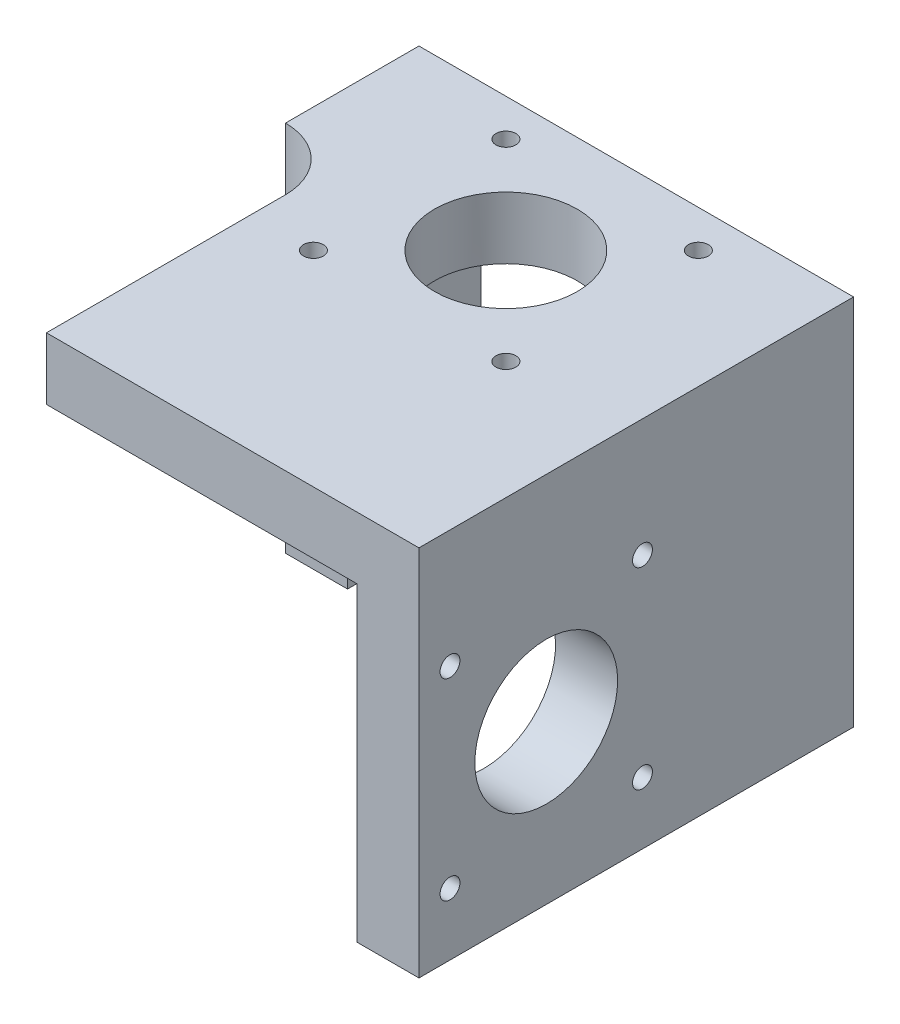
ISO-10303-21;
HEADER;
FILE_DESCRIPTION(('STEP AP214'),'2;1');
FILE_NAME('part.step','',(''),(''),'','','');
FILE_SCHEMA(('AUTOMOTIVE_DESIGN { 1 0 10303 214 1 1 1 1 }'));
ENDSEC;
DATA;
#1=APPLICATION_CONTEXT('core data for automotive mechanical design processes');
#2=APPLICATION_PROTOCOL_DEFINITION('international standard','automotive_design',2000,#1);
#3=PRODUCT_CONTEXT('',#1,'mechanical');
#4=PRODUCT('Part','Part','',(#3));
#5=PRODUCT_RELATED_PRODUCT_CATEGORY('part','',(#4));
#6=PRODUCT_DEFINITION_FORMATION('','',#4);
#7=PRODUCT_DEFINITION_CONTEXT('part definition',#1,'design');
#8=PRODUCT_DEFINITION('design','',#6,#7);
#9=PRODUCT_DEFINITION_SHAPE('','',#8);
#10=(LENGTH_UNIT() NAMED_UNIT(*) SI_UNIT(.MILLI.,.METRE.));
#11=(NAMED_UNIT(*) PLANE_ANGLE_UNIT() SI_UNIT($,.RADIAN.));
#12=(NAMED_UNIT(*) SI_UNIT($,.STERADIAN.) SOLID_ANGLE_UNIT());
#13=UNCERTAINTY_MEASURE_WITH_UNIT(LENGTH_MEASURE(1.E-05),#10,'distance_accuracy_value','');
#14=(GEOMETRIC_REPRESENTATION_CONTEXT(3) GLOBAL_UNCERTAINTY_ASSIGNED_CONTEXT((#13)) GLOBAL_UNIT_ASSIGNED_CONTEXT((#10,
#11,#12)) REPRESENTATION_CONTEXT('',''));
#15=CARTESIAN_POINT('',(0.,0.,0.));
#16=DIRECTION('',(0.,0.,1.));
#17=DIRECTION('',(1.,0.,0.));
#18=AXIS2_PLACEMENT_3D('',#15,#16,#17);
#19=CARTESIAN_POINT('',(0.,0.,21.5));
#20=DIRECTION('',(0.,0.,-1.));
#21=DIRECTION('',(-1.,0.,0.));
#22=AXIS2_PLACEMENT_3D('',#19,#20,#21);
#23=PLANE('',#22);
#24=DIRECTION('',(0.,-1.,0.));
#25=VECTOR('',#24,1.);
#26=CARTESIAN_POINT('',(-47.5,20.0735294117647,21.5));
#27=LINE('',#26,#25);
#28=CARTESIAN_POINT('',(-47.5,-23.4764705882353,21.5));
#29=VERTEX_POINT('',#28);
#30=CARTESIAN_POINT('',(-47.5,-39.9264705882353,21.5));
#31=VERTEX_POINT('',#30);
#32=EDGE_CURVE('E159',#29,#31,#27,.T.);
#33=ORIENTED_EDGE('',*,*,#32,.F.);
#34=DIRECTION('',(-1.,0.,0.));
#35=VECTOR('',#34,1.);
#36=CARTESIAN_POINT('',(-37.,-23.4764705882353,21.5));
#37=LINE('',#36,#35);
#38=CARTESIAN_POINT('',(-57.5,-23.4764705882353,21.5));
#39=VERTEX_POINT('',#38);
#40=EDGE_CURVE('E142',#29,#39,#37,.T.);
#41=ORIENTED_EDGE('',*,*,#40,.T.);
#42=DIRECTION('',(0.,1.,0.));
#43=VECTOR('',#42,1.);
#44=CARTESIAN_POINT('',(-57.5,20.0735294117647,21.5));
#45=LINE('',#44,#43);
#46=CARTESIAN_POINT('',(-57.5,-39.9264705882353,21.5));
#47=VERTEX_POINT('',#46);
#48=EDGE_CURVE('E157',#47,#39,#45,.T.);
#49=ORIENTED_EDGE('',*,*,#48,.F.);
#50=DIRECTION('',(-1.,0.,0.));
#51=VECTOR('',#50,1.);
#52=CARTESIAN_POINT('',(-47.5,-39.9264705882353,21.5));
#53=LINE('',#52,#51);
#54=EDGE_CURVE('E177',#31,#47,#53,.T.);
#55=ORIENTED_EDGE('',*,*,#54,.F.);
#56=EDGE_LOOP('',(#33,#41,#49,#55));
#57=FACE_BOUND('',#56,.T.);
#58=ADVANCED_FACE('F47',(#57),#23,.F.);
#59=CARTESIAN_POINT('',(0.,10.0735294117647,70.));
#60=DIRECTION('',(0.,1.,0.));
#61=DIRECTION('',(-1.,0.,0.));
#62=AXIS2_PLACEMENT_3D('',#59,#60,#61);
#63=PLANE('',#62);
#64=CARTESIAN_POINT('',(-22.,10.0735294117647,21.5));
#65=DIRECTION('',(0.,-1.,0.));
#66=DIRECTION('',(1.,0.,0.));
#67=AXIS2_PLACEMENT_3D('',#64,#65,#66);
#68=CIRCLE('',#67,11.5);
#69=CARTESIAN_POINT('',(-10.5,10.0735294117647,21.5));
#70=VERTEX_POINT('',#69);
#71=EDGE_CURVE('E241',#70,#70,#68,.T.);
#72=ORIENTED_EDGE('',*,*,#71,.F.);
#73=EDGE_LOOP('',(#72));
#74=FACE_BOUND('',#73,.T.);
#75=CARTESIAN_POINT('',(-6.49999999999999,10.0735294117647,37.));
#76=DIRECTION('',(0.,-1.,0.));
#77=DIRECTION('',(1.,0.,0.));
#78=AXIS2_PLACEMENT_3D('',#75,#76,#77);
#79=CIRCLE('',#78,1.59999999999999);
#80=CARTESIAN_POINT('',(-4.9,10.0735294117647,37.));
#81=VERTEX_POINT('',#80);
#82=EDGE_CURVE('E237',#81,#81,#79,.T.);
#83=ORIENTED_EDGE('',*,*,#82,.F.);
#84=EDGE_LOOP('',(#83));
#85=FACE_BOUND('',#84,.T.);
#86=CARTESIAN_POINT('',(-6.49999999999999,10.0735294117647,6.));
#87=DIRECTION('',(0.,-1.,0.));
#88=DIRECTION('',(1.,0.,0.));
#89=AXIS2_PLACEMENT_3D('',#86,#87,#88);
#90=CIRCLE('',#89,1.6);
#91=CARTESIAN_POINT('',(-4.89999999999999,10.0735294117647,6.));
#92=VERTEX_POINT('',#91);
#93=EDGE_CURVE('E233',#92,#92,#90,.T.);
#94=ORIENTED_EDGE('',*,*,#93,.F.);
#95=EDGE_LOOP('',(#94));
#96=FACE_BOUND('',#95,.T.);
#97=CARTESIAN_POINT('',(-37.5,10.0735294117647,6.));
#98=DIRECTION('',(0.,-1.,0.));
#99=DIRECTION('',(1.,0.,0.));
#100=AXIS2_PLACEMENT_3D('',#97,#98,#99);
#101=CIRCLE('',#100,1.6);
#102=CARTESIAN_POINT('',(-35.9,10.0735294117647,6.));
#103=VERTEX_POINT('',#102);
#104=EDGE_CURVE('E228',#103,#103,#101,.T.);
#105=ORIENTED_EDGE('',*,*,#104,.F.);
#106=EDGE_LOOP('',(#105));
#107=FACE_BOUND('',#106,.T.);
#108=CARTESIAN_POINT('',(-37.5,10.0735294117647,37.));
#109=DIRECTION('',(0.,-1.,0.));
#110=DIRECTION('',(1.,0.,0.));
#111=AXIS2_PLACEMENT_3D('',#108,#109,#110);
#112=CIRCLE('',#111,1.6);
#113=CARTESIAN_POINT('',(-35.9,10.0735294117647,37.));
#114=VERTEX_POINT('',#113);
#115=EDGE_CURVE('E232',#114,#114,#112,.T.);
#116=ORIENTED_EDGE('',*,*,#115,.F.);
#117=EDGE_LOOP('',(#116));
#118=FACE_BOUND('',#117,.T.);
#119=DIRECTION('',(0.,0.,-1.));
#120=VECTOR('',#119,1.);
#121=CARTESIAN_POINT('',(-47.5,10.0735294117647,70.));
#122=LINE('',#121,#120);
#123=CARTESIAN_POINT('',(-47.5,10.0735294117647,70.));
#124=VERTEX_POINT('',#123);
#125=CARTESIAN_POINT('',(-47.5,10.0735294117647,31.5));
#126=VERTEX_POINT('',#125);
#127=EDGE_CURVE('E294',#124,#126,#122,.T.);
#128=ORIENTED_EDGE('',*,*,#127,.T.);
#129=CARTESIAN_POINT('',(-47.5,10.0735294117647,0.));
#130=VERTEX_POINT('',#129);
#131=EDGE_CURVE('E273',#126,#130,#122,.T.);
#132=ORIENTED_EDGE('',*,*,#131,.T.);
#133=DIRECTION('',(1.,0.,0.));
#134=VECTOR('',#133,1.);
#135=CARTESIAN_POINT('',(0.,10.0735294117647,0.));
#136=LINE('',#135,#134);
#137=CARTESIAN_POINT('',(2.50000000000001,10.0735294117647,0.));
#138=VERTEX_POINT('',#137);
#139=EDGE_CURVE('E274',#130,#138,#136,.T.);
#140=ORIENTED_EDGE('',*,*,#139,.T.);
#141=DIRECTION('',(0.,0.,-1.));
#142=VECTOR('',#141,1.);
#143=CARTESIAN_POINT('',(2.50000000000001,10.0735294117647,70.));
#144=LINE('',#143,#142);
#145=CARTESIAN_POINT('',(2.50000000000001,10.0735294117647,70.));
#146=VERTEX_POINT('',#145);
#147=EDGE_CURVE('E311',#146,#138,#144,.T.);
#148=ORIENTED_EDGE('',*,*,#147,.F.);
#149=DIRECTION('',(1.,0.,0.));
#150=VECTOR('',#149,1.);
#151=CARTESIAN_POINT('',(0.,10.0735294117647,70.));
#152=LINE('',#151,#150);
#153=EDGE_CURVE('E250',#124,#146,#152,.T.);
#154=ORIENTED_EDGE('',*,*,#153,.F.);
#155=EDGE_LOOP('',(#128,#132,#140,#148,#154));
#156=FACE_BOUND('',#155,.T.);
#157=ADVANCED_FACE('F374',(#74,#85,#96,#107,#118,#156),#63,.F.);
#158=CARTESIAN_POINT('',(2.50000000000001,0.,70.));
#159=DIRECTION('',(1.,0.,0.));
#160=DIRECTION('',(0.,1.,0.));
#161=AXIS2_PLACEMENT_3D('',#158,#159,#160);
#162=PLANE('',#161);
#163=CARTESIAN_POINT('',(2.50000000000001,-14.4264705882353,49.5));
#164=DIRECTION('',(-1.,0.,0.));
#165=DIRECTION('',(0.,-1.,0.));
#166=AXIS2_PLACEMENT_3D('',#163,#164,#165);
#167=CIRCLE('',#166,11.5);
#168=CARTESIAN_POINT('',(2.50000000000002,-25.9264705882353,49.5));
#169=VERTEX_POINT('',#168);
#170=EDGE_CURVE('E205',#169,#169,#167,.T.);
#171=ORIENTED_EDGE('',*,*,#170,.F.);
#172=EDGE_LOOP('',(#171));
#173=FACE_BOUND('',#172,.T.);
#174=CARTESIAN_POINT('',(2.50000000000001,1.0735294117647,65.));
#175=DIRECTION('',(-1.,0.,0.));
#176=DIRECTION('',(0.,-1.,0.));
#177=AXIS2_PLACEMENT_3D('',#174,#175,#176);
#178=CIRCLE('',#177,1.60000000000001);
#179=CARTESIAN_POINT('',(2.50000000000001,-0.526470588235301,65.));
#180=VERTEX_POINT('',#179);
#181=EDGE_CURVE('E217',#180,#180,#178,.T.);
#182=ORIENTED_EDGE('',*,*,#181,.F.);
#183=EDGE_LOOP('',(#182));
#184=FACE_BOUND('',#183,.T.);
#185=CARTESIAN_POINT('',(2.50000000000002,-29.9264705882353,65.));
#186=DIRECTION('',(-1.,0.,0.));
#187=DIRECTION('',(0.,-1.,0.));
#188=AXIS2_PLACEMENT_3D('',#185,#186,#187);
#189=CIRCLE('',#188,1.6);
#190=CARTESIAN_POINT('',(2.50000000000002,-31.5264705882353,65.));
#191=VERTEX_POINT('',#190);
#192=EDGE_CURVE('E213',#191,#191,#189,.T.);
#193=ORIENTED_EDGE('',*,*,#192,.F.);
#194=EDGE_LOOP('',(#193));
#195=FACE_BOUND('',#194,.T.);
#196=CARTESIAN_POINT('',(2.50000000000002,-29.9264705882353,34.));
#197=DIRECTION('',(-1.,0.,0.));
#198=DIRECTION('',(0.,-1.,0.));
#199=AXIS2_PLACEMENT_3D('',#196,#197,#198);
#200=CIRCLE('',#199,1.6);
#201=CARTESIAN_POINT('',(2.50000000000002,-31.5264705882353,34.));
#202=VERTEX_POINT('',#201);
#203=EDGE_CURVE('E208',#202,#202,#200,.T.);
#204=ORIENTED_EDGE('',*,*,#203,.F.);
#205=EDGE_LOOP('',(#204));
#206=FACE_BOUND('',#205,.T.);
#207=CARTESIAN_POINT('',(2.50000000000001,1.0735294117647,34.));
#208=DIRECTION('',(-1.,0.,0.));
#209=DIRECTION('',(0.,-1.,0.));
#210=AXIS2_PLACEMENT_3D('',#207,#208,#209);
#211=CIRCLE('',#210,1.60000000000001);
#212=CARTESIAN_POINT('',(2.50000000000001,-0.526470588235301,34.));
#213=VERTEX_POINT('',#212);
#214=EDGE_CURVE('E212',#213,#213,#211,.T.);
#215=ORIENTED_EDGE('',*,*,#214,.F.);
#216=EDGE_LOOP('',(#215));
#217=FACE_BOUND('',#216,.T.);
#218=DIRECTION('',(0.,-1.,0.));
#219=VECTOR('',#218,1.);
#220=CARTESIAN_POINT('',(2.50000000000001,0.,0.));
#221=LINE('',#220,#219);
#222=CARTESIAN_POINT('',(2.50000000000002,-39.9264705882353,0.));
#223=VERTEX_POINT('',#222);
#224=EDGE_CURVE('E278',#138,#223,#221,.T.);
#225=ORIENTED_EDGE('',*,*,#224,.T.);
#226=DIRECTION('',(0.,0.,-1.));
#227=VECTOR('',#226,1.);
#228=CARTESIAN_POINT('',(2.50000000000002,-39.9264705882353,70.));
#229=LINE('',#228,#227);
#230=CARTESIAN_POINT('',(2.50000000000002,-39.9264705882353,70.));
#231=VERTEX_POINT('',#230);
#232=EDGE_CURVE('E308',#231,#223,#229,.T.);
#233=ORIENTED_EDGE('',*,*,#232,.F.);
#234=DIRECTION('',(0.,-1.,0.));
#235=VECTOR('',#234,1.);
#236=CARTESIAN_POINT('',(2.50000000000001,0.,70.));
#237=LINE('',#236,#235);
#238=EDGE_CURVE('E254',#146,#231,#237,.T.);
#239=ORIENTED_EDGE('',*,*,#238,.F.);
#240=ORIENTED_EDGE('',*,*,#147,.T.);
#241=EDGE_LOOP('',(#225,#233,#239,#240));
#242=FACE_BOUND('',#241,.T.);
#243=ADVANCED_FACE('F395',(#173,#184,#195,#206,#217,#242),#162,.F.);
#244=CARTESIAN_POINT('',(0.,-39.9264705882353,70.));
#245=DIRECTION('',(0.,-1.,0.));
#246=DIRECTION('',(1.,0.,0.));
#247=AXIS2_PLACEMENT_3D('',#244,#245,#246);
#248=PLANE('',#247);
#249=DIRECTION('',(-1.,0.,0.));
#250=VECTOR('',#249,1.);
#251=CARTESIAN_POINT('',(0.,-39.9264705882353,0.));
#252=LINE('',#251,#250);
#253=CARTESIAN_POINT('',(12.5,-39.9264705882353,0.));
#254=VERTEX_POINT('',#253);
#255=EDGE_CURVE('E283',#254,#223,#252,.T.);
#256=ORIENTED_EDGE('',*,*,#255,.F.);
#257=DIRECTION('',(0.,0.,-1.));
#258=VECTOR('',#257,1.);
#259=CARTESIAN_POINT('',(12.5,-39.9264705882353,70.));
#260=LINE('',#259,#258);
#261=CARTESIAN_POINT('',(12.5,-39.9264705882353,70.));
#262=VERTEX_POINT('',#261);
#263=EDGE_CURVE('E305',#262,#254,#260,.T.);
#264=ORIENTED_EDGE('',*,*,#263,.F.);
#265=DIRECTION('',(-1.,0.,0.));
#266=VECTOR('',#265,1.);
#267=CARTESIAN_POINT('',(0.,-39.9264705882353,70.));
#268=LINE('',#267,#266);
#269=EDGE_CURVE('E258',#262,#231,#268,.T.);
#270=ORIENTED_EDGE('',*,*,#269,.T.);
#271=ORIENTED_EDGE('',*,*,#232,.T.);
#272=EDGE_LOOP('',(#256,#264,#270,#271));
#273=FACE_BOUND('',#272,.T.);
#274=ADVANCED_FACE('F391',(#273),#248,.T.);
#275=CARTESIAN_POINT('',(12.5,0.,70.));
#276=DIRECTION('',(1.,0.,0.));
#277=DIRECTION('',(0.,1.,0.));
#278=AXIS2_PLACEMENT_3D('',#275,#276,#277);
#279=PLANE('',#278);
#280=CARTESIAN_POINT('',(12.5,-14.4264705882353,49.5));
#281=DIRECTION('',(1.,0.,0.));
#282=DIRECTION('',(0.,1.,0.));
#283=AXIS2_PLACEMENT_3D('',#280,#281,#282);
#284=CIRCLE('',#283,11.5);
#285=CARTESIAN_POINT('',(12.5,-2.9264705882353,49.5));
#286=VERTEX_POINT('',#285);
#287=EDGE_CURVE('E245',#286,#286,#284,.T.);
#288=ORIENTED_EDGE('',*,*,#287,.F.);
#289=EDGE_LOOP('',(#288));
#290=FACE_BOUND('',#289,.T.);
#291=CARTESIAN_POINT('',(12.5,1.07352941176471,65.));
#292=DIRECTION('',(1.,0.,0.));
#293=DIRECTION('',(0.,1.,0.));
#294=AXIS2_PLACEMENT_3D('',#291,#292,#293);
#295=CIRCLE('',#294,1.60000000000001);
#296=CARTESIAN_POINT('',(12.5,2.67352941176471,65.));
#297=VERTEX_POINT('',#296);
#298=EDGE_CURVE('E344',#297,#297,#295,.T.);
#299=ORIENTED_EDGE('',*,*,#298,.F.);
#300=EDGE_LOOP('',(#299));
#301=FACE_BOUND('',#300,.T.);
#302=CARTESIAN_POINT('',(12.5,-29.9264705882353,65.));
#303=DIRECTION('',(1.,0.,0.));
#304=DIRECTION('',(0.,1.,0.));
#305=AXIS2_PLACEMENT_3D('',#302,#303,#304);
#306=CIRCLE('',#305,1.6);
#307=CARTESIAN_POINT('',(12.5,-28.3264705882353,65.));
#308=VERTEX_POINT('',#307);
#309=EDGE_CURVE('E340',#308,#308,#306,.T.);
#310=ORIENTED_EDGE('',*,*,#309,.F.);
#311=EDGE_LOOP('',(#310));
#312=FACE_BOUND('',#311,.T.);
#313=CARTESIAN_POINT('',(12.5,-29.9264705882353,34.));
#314=DIRECTION('',(1.,0.,0.));
#315=DIRECTION('',(0.,1.,0.));
#316=AXIS2_PLACEMENT_3D('',#313,#314,#315);
#317=CIRCLE('',#316,1.6);
#318=CARTESIAN_POINT('',(12.5,-28.3264705882353,34.));
#319=VERTEX_POINT('',#318);
#320=EDGE_CURVE('E336',#319,#319,#317,.T.);
#321=ORIENTED_EDGE('',*,*,#320,.F.);
#322=EDGE_LOOP('',(#321));
#323=FACE_BOUND('',#322,.T.);
#324=CARTESIAN_POINT('',(12.5,1.07352941176471,34.));
#325=DIRECTION('',(1.,0.,0.));
#326=DIRECTION('',(0.,1.,0.));
#327=AXIS2_PLACEMENT_3D('',#324,#325,#326);
#328=CIRCLE('',#327,1.60000000000001);
#329=CARTESIAN_POINT('',(12.5,2.67352941176471,34.));
#330=VERTEX_POINT('',#329);
#331=EDGE_CURVE('E227',#330,#330,#328,.T.);
#332=ORIENTED_EDGE('',*,*,#331,.F.);
#333=EDGE_LOOP('',(#332));
#334=FACE_BOUND('',#333,.T.);
#335=DIRECTION('',(0.,-1.,0.));
#336=VECTOR('',#335,1.);
#337=CARTESIAN_POINT('',(12.5,0.,0.));
#338=LINE('',#337,#336);
#339=CARTESIAN_POINT('',(12.5,20.0735294117647,0.));
#340=VERTEX_POINT('',#339);
#341=EDGE_CURVE('E287',#340,#254,#338,.T.);
#342=ORIENTED_EDGE('',*,*,#341,.F.);
#343=DIRECTION('',(0.,0.,-1.));
#344=VECTOR('',#343,1.);
#345=CARTESIAN_POINT('',(12.5,20.0735294117647,70.));
#346=LINE('',#345,#344);
#347=CARTESIAN_POINT('',(12.5,20.0735294117647,70.));
#348=VERTEX_POINT('',#347);
#349=EDGE_CURVE('E302',#348,#340,#346,.T.);
#350=ORIENTED_EDGE('',*,*,#349,.F.);
#351=DIRECTION('',(0.,-1.,0.));
#352=VECTOR('',#351,1.);
#353=CARTESIAN_POINT('',(12.5,0.,70.));
#354=LINE('',#353,#352);
#355=EDGE_CURVE('E262',#348,#262,#354,.T.);
#356=ORIENTED_EDGE('',*,*,#355,.T.);
#357=ORIENTED_EDGE('',*,*,#263,.T.);
#358=EDGE_LOOP('',(#342,#350,#356,#357));
#359=FACE_BOUND('',#358,.T.);
#360=ADVANCED_FACE('F388',(#290,#301,#312,#323,#334,#359),#279,.T.);
#361=CARTESIAN_POINT('',(0.,20.0735294117647,70.));
#362=DIRECTION('',(0.,1.,0.));
#363=DIRECTION('',(-1.,0.,0.));
#364=AXIS2_PLACEMENT_3D('',#361,#362,#363);
#365=PLANE('',#364);
#366=CARTESIAN_POINT('',(-22.,20.0735294117647,21.5));
#367=DIRECTION('',(0.,1.,0.));
#368=DIRECTION('',(-1.,0.,0.));
#369=AXIS2_PLACEMENT_3D('',#366,#367,#368);
#370=CIRCLE('',#369,11.5);
#371=CARTESIAN_POINT('',(-33.5,20.0735294117647,21.5));
#372=VERTEX_POINT('',#371);
#373=EDGE_CURVE('E279',#372,#372,#370,.T.);
#374=ORIENTED_EDGE('',*,*,#373,.F.);
#375=EDGE_LOOP('',(#374));
#376=FACE_BOUND('',#375,.T.);
#377=CARTESIAN_POINT('',(-6.49999999999999,20.0735294117647,37.));
#378=DIRECTION('',(0.,1.,0.));
#379=DIRECTION('',(-1.,0.,0.));
#380=AXIS2_PLACEMENT_3D('',#377,#378,#379);
#381=CIRCLE('',#380,1.59999999999999);
#382=CARTESIAN_POINT('',(-8.09999999999999,20.0735294117647,37.));
#383=VERTEX_POINT('',#382);
#384=EDGE_CURVE('E326',#383,#383,#381,.T.);
#385=ORIENTED_EDGE('',*,*,#384,.F.);
#386=EDGE_LOOP('',(#385));
#387=FACE_BOUND('',#386,.T.);
#388=CARTESIAN_POINT('',(-6.49999999999999,20.0735294117647,6.));
#389=DIRECTION('',(0.,1.,0.));
#390=DIRECTION('',(-1.,0.,0.));
#391=AXIS2_PLACEMENT_3D('',#388,#389,#390);
#392=CIRCLE('',#391,1.6);
#393=CARTESIAN_POINT('',(-8.09999999999999,20.0735294117647,6.));
#394=VERTEX_POINT('',#393);
#395=EDGE_CURVE('E322',#394,#394,#392,.T.);
#396=ORIENTED_EDGE('',*,*,#395,.F.);
#397=EDGE_LOOP('',(#396));
#398=FACE_BOUND('',#397,.T.);
#399=CARTESIAN_POINT('',(-37.5,20.0735294117647,6.));
#400=DIRECTION('',(0.,1.,0.));
#401=DIRECTION('',(-1.,0.,0.));
#402=AXIS2_PLACEMENT_3D('',#399,#400,#401);
#403=CIRCLE('',#402,1.6);
#404=CARTESIAN_POINT('',(-39.1,20.0735294117647,6.));
#405=VERTEX_POINT('',#404);
#406=EDGE_CURVE('E318',#405,#405,#403,.T.);
#407=ORIENTED_EDGE('',*,*,#406,.F.);
#408=EDGE_LOOP('',(#407));
#409=FACE_BOUND('',#408,.T.);
#410=CARTESIAN_POINT('',(-37.5,20.0735294117647,37.));
#411=DIRECTION('',(0.,1.,0.));
#412=DIRECTION('',(-1.,0.,0.));
#413=AXIS2_PLACEMENT_3D('',#410,#411,#412);
#414=CIRCLE('',#413,1.6);
#415=CARTESIAN_POINT('',(-39.1,20.0735294117647,37.));
#416=VERTEX_POINT('',#415);
#417=EDGE_CURVE('E249',#416,#416,#414,.T.);
#418=ORIENTED_EDGE('',*,*,#417,.F.);
#419=EDGE_LOOP('',(#418));
#420=FACE_BOUND('',#419,.T.);
#421=DIRECTION('',(1.,0.,0.));
#422=VECTOR('',#421,1.);
#423=CARTESIAN_POINT('',(0.,20.0735294117647,0.));
#424=LINE('',#423,#422);
#425=CARTESIAN_POINT('',(-57.5,20.0735294117647,0.));
#426=VERTEX_POINT('',#425);
#427=EDGE_CURVE('E255',#426,#340,#424,.T.);
#428=ORIENTED_EDGE('',*,*,#427,.F.);
#429=DIRECTION('',(0.,0.,-1.));
#430=VECTOR('',#429,1.);
#431=CARTESIAN_POINT('',(-57.5,20.0735294117647,21.5));
#432=LINE('',#431,#430);
#433=CARTESIAN_POINT('',(-57.5,20.0735294117647,21.5));
#434=VERTEX_POINT('',#433);
#435=EDGE_CURVE('E202',#434,#426,#432,.T.);
#436=ORIENTED_EDGE('',*,*,#435,.F.);
#437=CARTESIAN_POINT('',(-57.5,20.0735294117647,31.5));
#438=DIRECTION('',(0.,1.,0.));
#439=DIRECTION('',(-1.,0.,0.));
#440=AXIS2_PLACEMENT_3D('',#437,#438,#439);
#441=CIRCLE('',#440,10.);
#442=CARTESIAN_POINT('',(-47.5,20.0735294117647,31.5));
#443=VERTEX_POINT('',#442);
#444=EDGE_CURVE('E356',#434,#443,#441,.F.);
#445=ORIENTED_EDGE('',*,*,#444,.T.);
#446=DIRECTION('',(0.,0.,-1.));
#447=VECTOR('',#446,1.);
#448=CARTESIAN_POINT('',(-47.5,20.0735294117647,70.));
#449=LINE('',#448,#447);
#450=CARTESIAN_POINT('',(-47.5,20.0735294117647,70.));
#451=VERTEX_POINT('',#450);
#452=EDGE_CURVE('E298',#451,#443,#449,.T.);
#453=ORIENTED_EDGE('',*,*,#452,.F.);
#454=DIRECTION('',(1.,0.,0.));
#455=VECTOR('',#454,1.);
#456=CARTESIAN_POINT('',(0.,20.0735294117647,70.));
#457=LINE('',#456,#455);
#458=EDGE_CURVE('E266',#451,#348,#457,.T.);
#459=ORIENTED_EDGE('',*,*,#458,.T.);
#460=ORIENTED_EDGE('',*,*,#349,.T.);
#461=EDGE_LOOP('',(#428,#436,#445,#453,#459,#460));
#462=FACE_BOUND('',#461,.T.);
#463=ADVANCED_FACE('F383',(#376,#387,#398,#409,#420,#462),#365,.T.);
#464=CARTESIAN_POINT('',(-47.5,0.,70.));
#465=DIRECTION('',(1.,0.,0.));
#466=DIRECTION('',(0.,0.,-1.));
#467=AXIS2_PLACEMENT_3D('',#464,#465,#466);
#468=PLANE('',#467);
#469=ORIENTED_EDGE('',*,*,#452,.T.);
#470=DIRECTION('',(0.,-1.,0.));
#471=VECTOR('',#470,1.);
#472=CARTESIAN_POINT('',(-47.5,10.0735294117647,31.5));
#473=LINE('',#472,#471);
#474=EDGE_CURVE('E161',#443,#126,#473,.T.);
#475=ORIENTED_EDGE('',*,*,#474,.T.);
#476=ORIENTED_EDGE('',*,*,#127,.F.);
#477=DIRECTION('',(0.,-1.,0.));
#478=VECTOR('',#477,1.);
#479=CARTESIAN_POINT('',(-47.5,0.,70.));
#480=LINE('',#479,#478);
#481=EDGE_CURVE('E270',#451,#124,#480,.T.);
#482=ORIENTED_EDGE('',*,*,#481,.F.);
#483=EDGE_LOOP('',(#469,#475,#476,#482));
#484=FACE_BOUND('',#483,.T.);
#485=ADVANCED_FACE('F369',(#484),#468,.F.);
#486=CARTESIAN_POINT('',(0.,0.,70.));
#487=DIRECTION('',(0.,0.,1.));
#488=DIRECTION('',(1.,0.,0.));
#489=AXIS2_PLACEMENT_3D('',#486,#487,#488);
#490=PLANE('',#489);
#491=ORIENTED_EDGE('',*,*,#153,.T.);
#492=ORIENTED_EDGE('',*,*,#238,.T.);
#493=ORIENTED_EDGE('',*,*,#269,.F.);
#494=ORIENTED_EDGE('',*,*,#355,.F.);
#495=ORIENTED_EDGE('',*,*,#458,.F.);
#496=ORIENTED_EDGE('',*,*,#481,.T.);
#497=EDGE_LOOP('',(#491,#492,#493,#494,#495,#496));
#498=FACE_BOUND('',#497,.T.);
#499=ADVANCED_FACE('F397',(#498),#490,.T.);
#500=CARTESIAN_POINT('',(0.,0.,0.));
#501=DIRECTION('',(0.,0.,1.));
#502=DIRECTION('',(1.,0.,0.));
#503=AXIS2_PLACEMENT_3D('',#500,#501,#502);
#504=PLANE('',#503);
#505=ORIENTED_EDGE('',*,*,#139,.F.);
#506=DIRECTION('',(0.,-1.,0.));
#507=VECTOR('',#506,1.);
#508=CARTESIAN_POINT('',(-47.5,20.0735294117647,0.));
#509=LINE('',#508,#507);
#510=CARTESIAN_POINT('',(-47.5,-39.9264705882353,0.));
#511=VERTEX_POINT('',#510);
#512=EDGE_CURVE('E190',#130,#511,#509,.T.);
#513=ORIENTED_EDGE('',*,*,#512,.T.);
#514=DIRECTION('',(-1.,0.,0.));
#515=VECTOR('',#514,1.);
#516=CARTESIAN_POINT('',(-47.5,-39.9264705882353,0.));
#517=LINE('',#516,#515);
#518=CARTESIAN_POINT('',(-57.5,-39.9264705882353,0.));
#519=VERTEX_POINT('',#518);
#520=EDGE_CURVE('E192',#511,#519,#517,.T.);
#521=ORIENTED_EDGE('',*,*,#520,.T.);
#522=DIRECTION('',(0.,1.,0.));
#523=VECTOR('',#522,1.);
#524=CARTESIAN_POINT('',(-57.5,20.0735294117647,0.));
#525=LINE('',#524,#523);
#526=EDGE_CURVE('E188',#519,#426,#525,.T.);
#527=ORIENTED_EDGE('',*,*,#526,.T.);
#528=ORIENTED_EDGE('',*,*,#427,.T.);
#529=ORIENTED_EDGE('',*,*,#341,.T.);
#530=ORIENTED_EDGE('',*,*,#255,.T.);
#531=ORIENTED_EDGE('',*,*,#224,.F.);
#532=EDGE_LOOP('',(#505,#513,#521,#527,#528,#529,#530,#531));
#533=FACE_BOUND('',#532,.T.);
#534=ADVANCED_FACE('F381',(#533),#504,.F.);
#535=CARTESIAN_POINT('',(-37.5,70.0735294117647,37.));
#536=DIRECTION('',(0.,-1.,0.));
#537=DIRECTION('',(1.,0.,0.));
#538=AXIS2_PLACEMENT_3D('',#535,#536,#537);
#539=CYLINDRICAL_SURFACE('',#538,1.6);
#540=ORIENTED_EDGE('',*,*,#417,.T.);
#541=EDGE_LOOP('',(#540));
#542=FACE_BOUND('',#541,.T.);
#543=ORIENTED_EDGE('',*,*,#115,.T.);
#544=EDGE_LOOP('',(#543));
#545=FACE_BOUND('',#544,.T.);
#546=ADVANCED_FACE('F405',(#542,#545),#539,.F.);
#547=CARTESIAN_POINT('',(-37.5,70.0735294117647,6.));
#548=DIRECTION('',(0.,-1.,0.));
#549=DIRECTION('',(1.,0.,0.));
#550=AXIS2_PLACEMENT_3D('',#547,#548,#549);
#551=CYLINDRICAL_SURFACE('',#550,1.6);
#552=ORIENTED_EDGE('',*,*,#406,.T.);
#553=EDGE_LOOP('',(#552));
#554=FACE_BOUND('',#553,.T.);
#555=ORIENTED_EDGE('',*,*,#104,.T.);
#556=EDGE_LOOP('',(#555));
#557=FACE_BOUND('',#556,.T.);
#558=ADVANCED_FACE('F453',(#554,#557),#551,.F.);
#559=CARTESIAN_POINT('',(-6.49999999999999,70.0735294117647,6.));
#560=DIRECTION('',(0.,-1.,0.));
#561=DIRECTION('',(1.,0.,0.));
#562=AXIS2_PLACEMENT_3D('',#559,#560,#561);
#563=CYLINDRICAL_SURFACE('',#562,1.6);
#564=ORIENTED_EDGE('',*,*,#395,.T.);
#565=EDGE_LOOP('',(#564));
#566=FACE_BOUND('',#565,.T.);
#567=ORIENTED_EDGE('',*,*,#93,.T.);
#568=EDGE_LOOP('',(#567));
#569=FACE_BOUND('',#568,.T.);
#570=ADVANCED_FACE('F456',(#566,#569),#563,.F.);
#571=CARTESIAN_POINT('',(-6.5,70.0735294117647,37.));
#572=DIRECTION('',(0.,-1.,0.));
#573=DIRECTION('',(1.,0.,0.));
#574=AXIS2_PLACEMENT_3D('',#571,#572,#573);
#575=CYLINDRICAL_SURFACE('',#574,1.59999999999999);
#576=ORIENTED_EDGE('',*,*,#384,.T.);
#577=EDGE_LOOP('',(#576));
#578=FACE_BOUND('',#577,.T.);
#579=ORIENTED_EDGE('',*,*,#82,.T.);
#580=EDGE_LOOP('',(#579));
#581=FACE_BOUND('',#580,.T.);
#582=ADVANCED_FACE('F460',(#578,#581),#575,.F.);
#583=CARTESIAN_POINT('',(-22.,70.0735294117647,21.5));
#584=DIRECTION('',(0.,-1.,0.));
#585=DIRECTION('',(1.,0.,0.));
#586=AXIS2_PLACEMENT_3D('',#583,#584,#585);
#587=CYLINDRICAL_SURFACE('',#586,11.5);
#588=ORIENTED_EDGE('',*,*,#373,.T.);
#589=EDGE_LOOP('',(#588));
#590=FACE_BOUND('',#589,.T.);
#591=ORIENTED_EDGE('',*,*,#71,.T.);
#592=EDGE_LOOP('',(#591));
#593=FACE_BOUND('',#592,.T.);
#594=ADVANCED_FACE('F451',(#590,#593),#587,.F.);
#595=CARTESIAN_POINT('',(62.5,1.07352941176471,34.));
#596=DIRECTION('',(-1.,0.,0.));
#597=DIRECTION('',(0.,-1.,0.));
#598=AXIS2_PLACEMENT_3D('',#595,#596,#597);
#599=CYLINDRICAL_SURFACE('',#598,1.60000000000001);
#600=ORIENTED_EDGE('',*,*,#331,.T.);
#601=EDGE_LOOP('',(#600));
#602=FACE_BOUND('',#601,.T.);
#603=ORIENTED_EDGE('',*,*,#214,.T.);
#604=EDGE_LOOP('',(#603));
#605=FACE_BOUND('',#604,.T.);
#606=ADVANCED_FACE('F437',(#602,#605),#599,.F.);
#607=CARTESIAN_POINT('',(62.5,-29.9264705882353,34.));
#608=DIRECTION('',(-1.,0.,0.));
#609=DIRECTION('',(0.,-1.,0.));
#610=AXIS2_PLACEMENT_3D('',#607,#608,#609);
#611=CYLINDRICAL_SURFACE('',#610,1.6);
#612=ORIENTED_EDGE('',*,*,#320,.T.);
#613=EDGE_LOOP('',(#612));
#614=FACE_BOUND('',#613,.T.);
#615=ORIENTED_EDGE('',*,*,#203,.T.);
#616=EDGE_LOOP('',(#615));
#617=FACE_BOUND('',#616,.T.);
#618=ADVANCED_FACE('F433',(#614,#617),#611,.F.);
#619=CARTESIAN_POINT('',(62.5,-29.9264705882353,65.));
#620=DIRECTION('',(-1.,0.,0.));
#621=DIRECTION('',(0.,-1.,0.));
#622=AXIS2_PLACEMENT_3D('',#619,#620,#621);
#623=CYLINDRICAL_SURFACE('',#622,1.6);
#624=ORIENTED_EDGE('',*,*,#309,.T.);
#625=EDGE_LOOP('',(#624));
#626=FACE_BOUND('',#625,.T.);
#627=ORIENTED_EDGE('',*,*,#192,.T.);
#628=EDGE_LOOP('',(#627));
#629=FACE_BOUND('',#628,.T.);
#630=ADVANCED_FACE('F436',(#626,#629),#623,.F.);
#631=CARTESIAN_POINT('',(62.5,1.07352941176471,65.));
#632=DIRECTION('',(-1.,0.,0.));
#633=DIRECTION('',(0.,-1.,0.));
#634=AXIS2_PLACEMENT_3D('',#631,#632,#633);
#635=CYLINDRICAL_SURFACE('',#634,1.60000000000001);
#636=ORIENTED_EDGE('',*,*,#298,.T.);
#637=EDGE_LOOP('',(#636));
#638=FACE_BOUND('',#637,.T.);
#639=ORIENTED_EDGE('',*,*,#181,.T.);
#640=EDGE_LOOP('',(#639));
#641=FACE_BOUND('',#640,.T.);
#642=ADVANCED_FACE('F441',(#638,#641),#635,.F.);
#643=CARTESIAN_POINT('',(62.5,-14.4264705882353,49.5));
#644=DIRECTION('',(-1.,0.,0.));
#645=DIRECTION('',(0.,-1.,0.));
#646=AXIS2_PLACEMENT_3D('',#643,#644,#645);
#647=CYLINDRICAL_SURFACE('',#646,11.5);
#648=ORIENTED_EDGE('',*,*,#287,.T.);
#649=EDGE_LOOP('',(#648));
#650=FACE_BOUND('',#649,.T.);
#651=ORIENTED_EDGE('',*,*,#170,.T.);
#652=EDGE_LOOP('',(#651));
#653=FACE_BOUND('',#652,.T.);
#654=ADVANCED_FACE('F432',(#650,#653),#647,.F.);
#655=CARTESIAN_POINT('',(-47.5,20.0735294117647,21.5));
#656=DIRECTION('',(1.,0.,0.));
#657=DIRECTION('',(0.,1.,0.));
#658=AXIS2_PLACEMENT_3D('',#655,#656,#657);
#659=PLANE('',#658);
#660=CARTESIAN_POINT('',(-47.5,-18.9264705882353,21.5));
#661=DIRECTION('',(1.,0.,0.));
#662=DIRECTION('',(0.,1.,0.));
#663=AXIS2_PLACEMENT_3D('',#660,#661,#662);
#664=CIRCLE('',#663,4.55);
#665=CARTESIAN_POINT('',(-47.5,-14.3764705882353,21.5));
#666=VERTEX_POINT('',#665);
#667=EDGE_CURVE('E151',#29,#666,#664,.T.);
#668=ORIENTED_EDGE('',*,*,#667,.F.);
#669=ORIENTED_EDGE('',*,*,#32,.T.);
#670=DIRECTION('',(0.,0.,-1.));
#671=VECTOR('',#670,1.);
#672=CARTESIAN_POINT('',(-47.5,-39.9264705882353,21.5));
#673=LINE('',#672,#671);
#674=EDGE_CURVE('E167',#31,#511,#673,.T.);
#675=ORIENTED_EDGE('',*,*,#674,.T.);
#676=ORIENTED_EDGE('',*,*,#512,.F.);
#677=ORIENTED_EDGE('',*,*,#131,.F.);
#678=CARTESIAN_POINT('',(-47.5,0.0735294117647016,31.5));
#679=DIRECTION('',(1.,0.,0.));
#680=DIRECTION('',(0.,1.,0.));
#681=AXIS2_PLACEMENT_3D('',#678,#679,#680);
#682=CIRCLE('',#681,10.);
#683=CARTESIAN_POINT('',(-47.5,0.0735294117647015,21.5));
#684=VERTEX_POINT('',#683);
#685=EDGE_CURVE('E11',#126,#684,#682,.F.);
#686=ORIENTED_EDGE('',*,*,#685,.T.);
#687=EDGE_CURVE('E181',#684,#666,#27,.T.);
#688=ORIENTED_EDGE('',*,*,#687,.T.);
#689=EDGE_LOOP('',(#668,#669,#675,#676,#677,#686,#688));
#690=FACE_BOUND('',#689,.T.);
#691=ADVANCED_FACE('F378',(#690),#659,.T.);
#692=CARTESIAN_POINT('',(-57.5,20.0735294117647,21.5));
#693=DIRECTION('',(-1.,0.,0.));
#694=DIRECTION('',(0.,-1.,0.));
#695=AXIS2_PLACEMENT_3D('',#692,#693,#694);
#696=PLANE('',#695);
#697=CARTESIAN_POINT('',(-57.5,-18.9264705882353,21.5));
#698=DIRECTION('',(-1.,0.,0.));
#699=DIRECTION('',(0.,-1.,0.));
#700=AXIS2_PLACEMENT_3D('',#697,#698,#699);
#701=CIRCLE('',#700,4.55);
#702=CARTESIAN_POINT('',(-57.5,-14.3764705882353,21.5));
#703=VERTEX_POINT('',#702);
#704=EDGE_CURVE('E138',#703,#39,#701,.T.);
#705=ORIENTED_EDGE('',*,*,#704,.F.);
#706=CARTESIAN_POINT('',(-57.5,0.0735294117647015,21.5));
#707=VERTEX_POINT('',#706);
#708=EDGE_CURVE('E168',#703,#707,#45,.T.);
#709=ORIENTED_EDGE('',*,*,#708,.T.);
#710=EDGE_CURVE('E63',#707,#434,#45,.T.);
#711=ORIENTED_EDGE('',*,*,#710,.T.);
#712=ORIENTED_EDGE('',*,*,#435,.T.);
#713=ORIENTED_EDGE('',*,*,#526,.F.);
#714=DIRECTION('',(0.,0.,-1.));
#715=VECTOR('',#714,1.);
#716=CARTESIAN_POINT('',(-57.5,-39.9264705882353,21.5));
#717=LINE('',#716,#715);
#718=EDGE_CURVE('E165',#47,#519,#717,.T.);
#719=ORIENTED_EDGE('',*,*,#718,.F.);
#720=ORIENTED_EDGE('',*,*,#48,.T.);
#721=EDGE_LOOP('',(#705,#709,#711,#712,#713,#719,#720));
#722=FACE_BOUND('',#721,.T.);
#723=ADVANCED_FACE('F163',(#722),#696,.T.);
#724=CARTESIAN_POINT('',(-47.5,-39.9264705882353,21.5));
#725=DIRECTION('',(0.,-1.,0.));
#726=DIRECTION('',(0.,0.,-1.));
#727=AXIS2_PLACEMENT_3D('',#724,#725,#726);
#728=PLANE('',#727);
#729=ORIENTED_EDGE('',*,*,#520,.F.);
#730=ORIENTED_EDGE('',*,*,#674,.F.);
#731=ORIENTED_EDGE('',*,*,#54,.T.);
#732=ORIENTED_EDGE('',*,*,#718,.T.);
#733=EDGE_LOOP('',(#729,#730,#731,#732));
#734=FACE_BOUND('',#733,.T.);
#735=ADVANCED_FACE('F380',(#734),#728,.T.);
#736=ORIENTED_EDGE('',*,*,#687,.F.);
#737=DIRECTION('',(-1.,0.,0.));
#738=VECTOR('',#737,1.);
#739=CARTESIAN_POINT('',(-57.5,0.0735294117647009,21.5));
#740=LINE('',#739,#738);
#741=EDGE_CURVE('E359',#684,#707,#740,.T.);
#742=ORIENTED_EDGE('',*,*,#741,.T.);
#743=ORIENTED_EDGE('',*,*,#708,.F.);
#744=DIRECTION('',(-1.,0.,0.));
#745=VECTOR('',#744,1.);
#746=CARTESIAN_POINT('',(-37.,-14.3764705882353,21.5));
#747=LINE('',#746,#745);
#748=EDGE_CURVE('E145',#703,#666,#747,.F.);
#749=ORIENTED_EDGE('',*,*,#748,.T.);
#750=EDGE_LOOP('',(#736,#742,#743,#749));
#751=FACE_BOUND('',#750,.T.);
#752=ADVANCED_FACE('F377',(#751),#23,.F.);
#753=CARTESIAN_POINT('',(-37.,-18.9264705882353,21.5));
#754=DIRECTION('',(-1.,0.,0.));
#755=DIRECTION('',(0.,-1.,0.));
#756=AXIS2_PLACEMENT_3D('',#753,#754,#755);
#757=CYLINDRICAL_SURFACE('',#756,4.55);
#758=ORIENTED_EDGE('',*,*,#667,.T.);
#759=ORIENTED_EDGE('',*,*,#748,.F.);
#760=ORIENTED_EDGE('',*,*,#704,.T.);
#761=ORIENTED_EDGE('',*,*,#40,.F.);
#762=EDGE_LOOP('',(#758,#759,#760,#761));
#763=FACE_BOUND('',#762,.T.);
#764=ADVANCED_FACE('F141',(#763),#757,.F.);
#765=CARTESIAN_POINT('',(-57.5,0.,31.5));
#766=DIRECTION('',(0.,1.,0.));
#767=DIRECTION('',(0.,0.,1.));
#768=AXIS2_PLACEMENT_3D('',#765,#766,#767);
#769=CYLINDRICAL_SURFACE('',#768,10.);
#770=ORIENTED_EDGE('',*,*,#444,.F.);
#771=ORIENTED_EDGE('',*,*,#710,.F.);
#772=CARTESIAN_POINT('',(-57.5,0.0735294117647009,31.5));
#773=DIRECTION('',(-0.707106781186548,0.707106781186547,0.));
#774=DIRECTION('',(0.707106781186547,0.707106781186547,0.));
#775=AXIS2_PLACEMENT_3D('',#772,#773,#774);
#776=ELLIPSE('',#775,14.142135623731,10.);
#777=EDGE_CURVE('E56',#707,#126,#776,.F.);
#778=ORIENTED_EDGE('',*,*,#777,.T.);
#779=ORIENTED_EDGE('',*,*,#474,.F.);
#780=EDGE_LOOP('',(#770,#771,#778,#779));
#781=FACE_BOUND('',#780,.T.);
#782=ADVANCED_FACE('F364',(#781),#769,.F.);
#783=CARTESIAN_POINT('',(0.,0.0735294117647049,31.5));
#784=DIRECTION('',(1.,0.,0.));
#785=DIRECTION('',(0.,1.,0.));
#786=AXIS2_PLACEMENT_3D('',#783,#784,#785);
#787=CYLINDRICAL_SURFACE('',#786,10.);
#788=ORIENTED_EDGE('',*,*,#741,.F.);
#789=ORIENTED_EDGE('',*,*,#685,.F.);
#790=ORIENTED_EDGE('',*,*,#777,.F.);
#791=EDGE_LOOP('',(#788,#789,#790));
#792=FACE_BOUND('',#791,.T.);
#793=ADVANCED_FACE('F49',(#792),#787,.F.);
#794=CLOSED_SHELL('',(#58,#157,#243,#274,#360,#463,#485,#499,#534,#546,#558,#570,#582,#594,#606,
#618,#630,#642,#654,#691,#723,#735,#752,#764,#782,#793));
#795=MANIFOLD_SOLID_BREP('B2',#794);
#796=ADVANCED_BREP_SHAPE_REPRESENTATION('',(#18,#795),#14);
#797=SHAPE_DEFINITION_REPRESENTATION(#9,#796);
ENDSEC;
END-ISO-10303-21;
